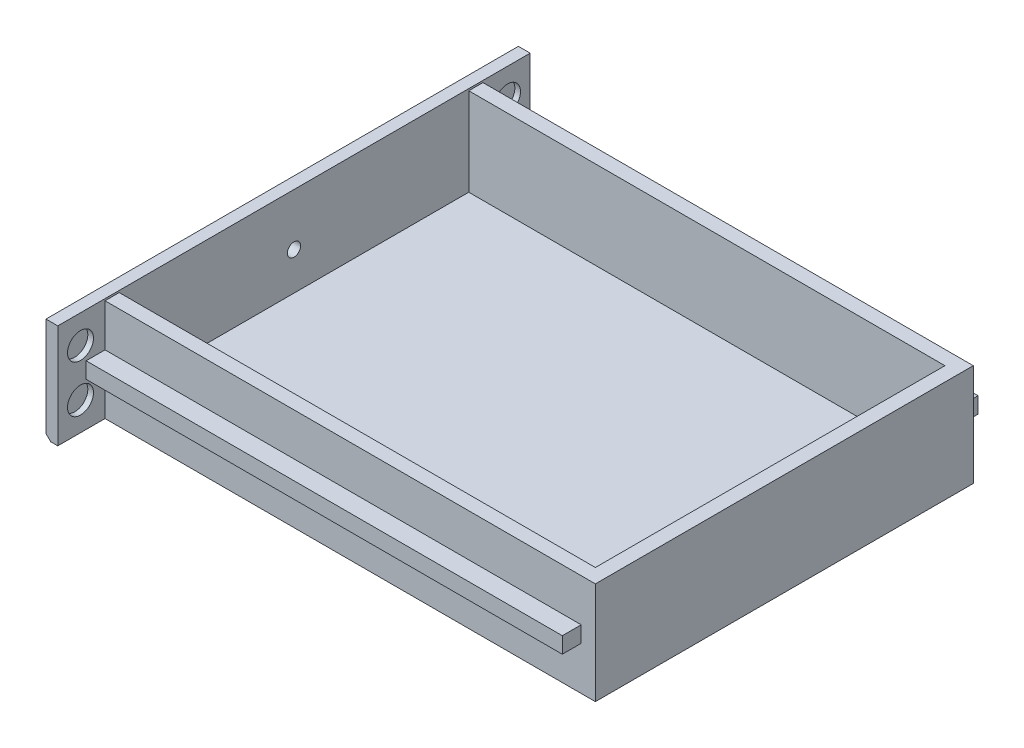
ISO-10303-21;
HEADER;
FILE_DESCRIPTION(('STEP AP214'),'2;1');
FILE_NAME('part.step','',(''),(''),'','','');
FILE_SCHEMA(('AUTOMOTIVE_DESIGN { 1 0 10303 214 1 1 1 1 }'));
ENDSEC;
DATA;
#1=APPLICATION_CONTEXT('core data for automotive mechanical design processes');
#2=APPLICATION_PROTOCOL_DEFINITION('international standard','automotive_design',2000,#1);
#3=PRODUCT_CONTEXT('',#1,'mechanical');
#4=PRODUCT('Part','Part','',(#3));
#5=PRODUCT_RELATED_PRODUCT_CATEGORY('part','',(#4));
#6=PRODUCT_DEFINITION_FORMATION('','',#4);
#7=PRODUCT_DEFINITION_CONTEXT('part definition',#1,'design');
#8=PRODUCT_DEFINITION('design','',#6,#7);
#9=PRODUCT_DEFINITION_SHAPE('','',#8);
#10=(LENGTH_UNIT() NAMED_UNIT(*) SI_UNIT(.MILLI.,.METRE.));
#11=(NAMED_UNIT(*) PLANE_ANGLE_UNIT() SI_UNIT($,.RADIAN.));
#12=(NAMED_UNIT(*) SI_UNIT($,.STERADIAN.) SOLID_ANGLE_UNIT());
#13=UNCERTAINTY_MEASURE_WITH_UNIT(LENGTH_MEASURE(1.E-05),#10,'distance_accuracy_value','');
#14=(GEOMETRIC_REPRESENTATION_CONTEXT(3) GLOBAL_UNCERTAINTY_ASSIGNED_CONTEXT((#13)) GLOBAL_UNIT_ASSIGNED_CONTEXT((#10,
#11,#12)) REPRESENTATION_CONTEXT('',''));
#15=CARTESIAN_POINT('',(0.,0.,0.));
#16=DIRECTION('',(0.,0.,1.));
#17=DIRECTION('',(1.,0.,0.));
#18=AXIS2_PLACEMENT_3D('',#15,#16,#17);
#19=CARTESIAN_POINT('',(103.3,0.,0.));
#20=DIRECTION('',(1.,0.,0.));
#21=DIRECTION('',(0.,0.,-1.));
#22=AXIS2_PLACEMENT_3D('',#19,#20,#21);
#23=PLANE('',#22);
#24=DIRECTION('',(0.,-1.,0.));
#25=VECTOR('',#24,1.);
#26=CARTESIAN_POINT('',(103.3,10.6,40.));
#27=LINE('',#26,#25);
#28=CARTESIAN_POINT('',(103.3,1.6,40.));
#29=VERTEX_POINT('',#28);
#30=CARTESIAN_POINT('',(103.3,-1.8,40.));
#31=VERTEX_POINT('',#30);
#32=EDGE_CURVE('E217',#29,#31,#27,.T.);
#33=ORIENTED_EDGE('',*,*,#32,.F.);
#34=DIRECTION('',(0.,0.,1.));
#35=VECTOR('',#34,1.);
#36=CARTESIAN_POINT('',(103.3,1.6,40.));
#37=LINE('',#36,#35);
#38=CARTESIAN_POINT('',(103.3,1.6,44.));
#39=VERTEX_POINT('',#38);
#40=EDGE_CURVE('E228',#29,#39,#37,.T.);
#41=ORIENTED_EDGE('',*,*,#40,.T.);
#42=DIRECTION('',(0.,-1.,0.));
#43=VECTOR('',#42,1.);
#44=CARTESIAN_POINT('',(103.3,1.6,44.));
#45=LINE('',#44,#43);
#46=CARTESIAN_POINT('',(103.3,-1.8,44.));
#47=VERTEX_POINT('',#46);
#48=EDGE_CURVE('E231',#39,#47,#45,.T.);
#49=ORIENTED_EDGE('',*,*,#48,.T.);
#50=DIRECTION('',(0.,0.,-1.));
#51=VECTOR('',#50,1.);
#52=CARTESIAN_POINT('',(103.3,-1.8,44.));
#53=LINE('',#52,#51);
#54=EDGE_CURVE('E233',#47,#31,#53,.T.);
#55=ORIENTED_EDGE('',*,*,#54,.T.);
#56=EDGE_LOOP('',(#33,#41,#49,#55));
#57=FACE_BOUND('',#56,.T.);
#58=ADVANCED_FACE('F34',(#57),#23,.T.);
#59=CARTESIAN_POINT('',(2.5,0.,0.));
#60=DIRECTION('',(-1.,0.,0.));
#61=DIRECTION('',(0.,0.,1.));
#62=AXIS2_PLACEMENT_3D('',#59,#60,#61);
#63=PLANE('',#62);
#64=CARTESIAN_POINT('',(2.5,0.,0.));
#65=DIRECTION('',(-1.,0.,0.));
#66=DIRECTION('',(0.,0.,1.));
#67=AXIS2_PLACEMENT_3D('',#64,#65,#66);
#68=CIRCLE('',#67,1.4);
#69=CARTESIAN_POINT('',(2.5,0.,1.4));
#70=VERTEX_POINT('',#69);
#71=EDGE_CURVE('E209',#70,#70,#68,.T.);
#72=ORIENTED_EDGE('',*,*,#71,.T.);
#73=EDGE_LOOP('',(#72));
#74=FACE_BOUND('',#73,.T.);
#75=CARTESIAN_POINT('',(2.5,5.,-45.2));
#76=DIRECTION('',(1.,0.,0.));
#77=DIRECTION('',(0.,0.,-1.));
#78=AXIS2_PLACEMENT_3D('',#75,#76,#77);
#79=CIRCLE('',#78,2.75);
#80=CARTESIAN_POINT('',(2.5,5.,-47.95));
#81=VERTEX_POINT('',#80);
#82=EDGE_CURVE('E331',#81,#81,#79,.T.);
#83=ORIENTED_EDGE('',*,*,#82,.F.);
#84=EDGE_LOOP('',(#83));
#85=FACE_BOUND('',#84,.T.);
#86=CARTESIAN_POINT('',(2.5,-5.,45.2));
#87=DIRECTION('',(1.,0.,0.));
#88=DIRECTION('',(0.,0.,1.));
#89=AXIS2_PLACEMENT_3D('',#86,#87,#88);
#90=CIRCLE('',#89,2.74999999999999);
#91=CARTESIAN_POINT('',(2.5,-5.,47.95));
#92=VERTEX_POINT('',#91);
#93=EDGE_CURVE('E327',#92,#92,#90,.T.);
#94=ORIENTED_EDGE('',*,*,#93,.F.);
#95=EDGE_LOOP('',(#94));
#96=FACE_BOUND('',#95,.T.);
#97=CARTESIAN_POINT('',(2.5,5.,45.2));
#98=DIRECTION('',(1.,0.,0.));
#99=DIRECTION('',(0.,0.,1.));
#100=AXIS2_PLACEMENT_3D('',#97,#98,#99);
#101=CIRCLE('',#100,2.75);
#102=CARTESIAN_POINT('',(2.5,5.,47.95));
#103=VERTEX_POINT('',#102);
#104=EDGE_CURVE('E338',#103,#103,#101,.T.);
#105=ORIENTED_EDGE('',*,*,#104,.F.);
#106=EDGE_LOOP('',(#105));
#107=FACE_BOUND('',#106,.T.);
#108=CARTESIAN_POINT('',(2.5,-5.,-45.2));
#109=DIRECTION('',(1.,0.,0.));
#110=DIRECTION('',(0.,0.,-1.));
#111=AXIS2_PLACEMENT_3D('',#108,#109,#110);
#112=CIRCLE('',#111,2.74999999999999);
#113=CARTESIAN_POINT('',(2.5,-5.,-47.95));
#114=VERTEX_POINT('',#113);
#115=EDGE_CURVE('E332',#114,#114,#112,.T.);
#116=ORIENTED_EDGE('',*,*,#115,.F.);
#117=EDGE_LOOP('',(#116));
#118=FACE_BOUND('',#117,.T.);
#119=DIRECTION('',(0.,1.,0.));
#120=VECTOR('',#119,1.);
#121=CARTESIAN_POINT('',(2.5,-1.8,-40.));
#122=LINE('',#121,#120);
#123=CARTESIAN_POINT('',(2.5,-11.,-40.));
#124=VERTEX_POINT('',#123);
#125=CARTESIAN_POINT('',(2.5,-1.8,-40.));
#126=VERTEX_POINT('',#125);
#127=EDGE_CURVE('E265',#124,#126,#122,.T.);
#128=ORIENTED_EDGE('',*,*,#127,.F.);
#129=DIRECTION('',(0.,0.,-1.));
#130=VECTOR('',#129,1.);
#131=CARTESIAN_POINT('',(2.5,-11.,50.));
#132=LINE('',#131,#130);
#133=CARTESIAN_POINT('',(2.5,-11.,-50.));
#134=VERTEX_POINT('',#133);
#135=EDGE_CURVE('E360',#124,#134,#132,.T.);
#136=ORIENTED_EDGE('',*,*,#135,.T.);
#137=DIRECTION('',(0.,1.,0.));
#138=VECTOR('',#137,1.);
#139=CARTESIAN_POINT('',(2.5,-11.,-50.));
#140=LINE('',#139,#138);
#141=CARTESIAN_POINT('',(2.5,11.,-50.));
#142=VERTEX_POINT('',#141);
#143=EDGE_CURVE('E352',#134,#142,#140,.T.);
#144=ORIENTED_EDGE('',*,*,#143,.T.);
#145=DIRECTION('',(0.,0.,1.));
#146=VECTOR('',#145,1.);
#147=CARTESIAN_POINT('',(2.5,11.,50.));
#148=LINE('',#147,#146);
#149=CARTESIAN_POINT('',(2.5,11.,50.));
#150=VERTEX_POINT('',#149);
#151=EDGE_CURVE('E355',#142,#150,#148,.T.);
#152=ORIENTED_EDGE('',*,*,#151,.T.);
#153=DIRECTION('',(0.,-1.,0.));
#154=VECTOR('',#153,1.);
#155=CARTESIAN_POINT('',(2.5,-11.,50.));
#156=LINE('',#155,#154);
#157=CARTESIAN_POINT('',(2.5,-11.,50.));
#158=VERTEX_POINT('',#157);
#159=EDGE_CURVE('E358',#150,#158,#156,.T.);
#160=ORIENTED_EDGE('',*,*,#159,.T.);
#161=CARTESIAN_POINT('',(2.5,-11.,40.));
#162=VERTEX_POINT('',#161);
#163=EDGE_CURVE('E361',#158,#162,#132,.T.);
#164=ORIENTED_EDGE('',*,*,#163,.T.);
#165=DIRECTION('',(0.,-1.,0.));
#166=VECTOR('',#165,1.);
#167=CARTESIAN_POINT('',(2.5,-1.8,40.));
#168=LINE('',#167,#166);
#169=CARTESIAN_POINT('',(2.5,-1.8,40.));
#170=VERTEX_POINT('',#169);
#171=EDGE_CURVE('E185',#170,#162,#168,.T.);
#172=ORIENTED_EDGE('',*,*,#171,.F.);
#173=DIRECTION('',(0.,0.,-1.));
#174=VECTOR('',#173,1.);
#175=CARTESIAN_POINT('',(2.5,-1.8,44.));
#176=LINE('',#175,#174);
#177=CARTESIAN_POINT('',(2.5,-1.8,44.));
#178=VERTEX_POINT('',#177);
#179=EDGE_CURVE('E261',#178,#170,#176,.T.);
#180=ORIENTED_EDGE('',*,*,#179,.F.);
#181=DIRECTION('',(0.,-1.,0.));
#182=VECTOR('',#181,1.);
#183=CARTESIAN_POINT('',(2.5,1.6,44.));
#184=LINE('',#183,#182);
#185=CARTESIAN_POINT('',(2.5,1.6,44.));
#186=VERTEX_POINT('',#185);
#187=EDGE_CURVE('E258',#186,#178,#184,.T.);
#188=ORIENTED_EDGE('',*,*,#187,.F.);
#189=DIRECTION('',(0.,0.,1.));
#190=VECTOR('',#189,1.);
#191=CARTESIAN_POINT('',(2.5,1.6,40.));
#192=LINE('',#191,#190);
#193=CARTESIAN_POINT('',(2.5,1.6,40.));
#194=VERTEX_POINT('',#193);
#195=EDGE_CURVE('E255',#194,#186,#192,.T.);
#196=ORIENTED_EDGE('',*,*,#195,.F.);
#197=DIRECTION('',(0.,-1.,0.));
#198=VECTOR('',#197,1.);
#199=CARTESIAN_POINT('',(2.5,1.6,40.));
#200=LINE('',#199,#198);
#201=CARTESIAN_POINT('',(2.5,10.6,40.));
#202=VERTEX_POINT('',#201);
#203=EDGE_CURVE('E253',#202,#194,#200,.T.);
#204=ORIENTED_EDGE('',*,*,#203,.F.);
#205=DIRECTION('',(0.,0.,1.));
#206=VECTOR('',#205,1.);
#207=CARTESIAN_POINT('',(2.5,10.6,40.));
#208=LINE('',#207,#206);
#209=CARTESIAN_POINT('',(2.5,10.6,37.));
#210=VERTEX_POINT('',#209);
#211=EDGE_CURVE('E250',#210,#202,#208,.T.);
#212=ORIENTED_EDGE('',*,*,#211,.F.);
#213=DIRECTION('',(0.,1.,0.));
#214=VECTOR('',#213,1.);
#215=CARTESIAN_POINT('',(2.5,10.6,37.));
#216=LINE('',#215,#214);
#217=CARTESIAN_POINT('',(2.5,-8.,37.));
#218=VERTEX_POINT('',#217);
#219=EDGE_CURVE('E216',#218,#210,#216,.T.);
#220=ORIENTED_EDGE('',*,*,#219,.F.);
#221=DIRECTION('',(0.,0.,1.));
#222=VECTOR('',#221,1.);
#223=CARTESIAN_POINT('',(2.5,-8.,37.));
#224=LINE('',#223,#222);
#225=CARTESIAN_POINT('',(2.5,-8.,-37.));
#226=VERTEX_POINT('',#225);
#227=EDGE_CURVE('E229',#226,#218,#224,.T.);
#228=ORIENTED_EDGE('',*,*,#227,.F.);
#229=DIRECTION('',(0.,-1.,0.));
#230=VECTOR('',#229,1.);
#231=CARTESIAN_POINT('',(2.5,10.6,-37.));
#232=LINE('',#231,#230);
#233=CARTESIAN_POINT('',(2.5,10.6,-37.));
#234=VERTEX_POINT('',#233);
#235=EDGE_CURVE('E283',#234,#226,#232,.T.);
#236=ORIENTED_EDGE('',*,*,#235,.F.);
#237=DIRECTION('',(0.,0.,1.));
#238=VECTOR('',#237,1.);
#239=CARTESIAN_POINT('',(2.5,10.6,-40.));
#240=LINE('',#239,#238);
#241=CARTESIAN_POINT('',(2.5,10.6,-40.));
#242=VERTEX_POINT('',#241);
#243=EDGE_CURVE('E280',#242,#234,#240,.T.);
#244=ORIENTED_EDGE('',*,*,#243,.F.);
#245=DIRECTION('',(0.,1.,0.));
#246=VECTOR('',#245,1.);
#247=CARTESIAN_POINT('',(2.5,1.6,-40.));
#248=LINE('',#247,#246);
#249=CARTESIAN_POINT('',(2.5,1.6,-40.));
#250=VERTEX_POINT('',#249);
#251=EDGE_CURVE('E277',#250,#242,#248,.T.);
#252=ORIENTED_EDGE('',*,*,#251,.F.);
#253=DIRECTION('',(0.,0.,1.));
#254=VECTOR('',#253,1.);
#255=CARTESIAN_POINT('',(2.5,1.6,-40.));
#256=LINE('',#255,#254);
#257=CARTESIAN_POINT('',(2.5,1.6,-44.));
#258=VERTEX_POINT('',#257);
#259=EDGE_CURVE('E274',#258,#250,#256,.T.);
#260=ORIENTED_EDGE('',*,*,#259,.F.);
#261=DIRECTION('',(0.,1.,0.));
#262=VECTOR('',#261,1.);
#263=CARTESIAN_POINT('',(2.5,1.6,-44.));
#264=LINE('',#263,#262);
#265=CARTESIAN_POINT('',(2.5,-1.8,-44.));
#266=VERTEX_POINT('',#265);
#267=EDGE_CURVE('E271',#266,#258,#264,.T.);
#268=ORIENTED_EDGE('',*,*,#267,.F.);
#269=DIRECTION('',(0.,0.,-1.));
#270=VECTOR('',#269,1.);
#271=CARTESIAN_POINT('',(2.5,-1.8,-44.));
#272=LINE('',#271,#270);
#273=EDGE_CURVE('E268',#126,#266,#272,.T.);
#274=ORIENTED_EDGE('',*,*,#273,.F.);
#275=EDGE_LOOP('',(#128,#136,#144,#152,#160,#164,#172,#180,#188,#196,#204,#212,#220,#228,#236,
#244,#252,#260,#268,#274));
#276=FACE_BOUND('',#275,.T.);
#277=ADVANCED_FACE('F387',(#74,#85,#96,#107,#118,#276),#63,.F.);
#278=CARTESIAN_POINT('',(2.5,-11.,-50.));
#279=DIRECTION('',(0.,0.,1.));
#280=DIRECTION('',(1.,0.,0.));
#281=AXIS2_PLACEMENT_3D('',#278,#279,#280);
#282=PLANE('',#281);
#283=DIRECTION('',(-1.,0.,0.));
#284=VECTOR('',#283,1.);
#285=CARTESIAN_POINT('',(2.5,-11.,-50.));
#286=LINE('',#285,#284);
#287=CARTESIAN_POINT('',(0.999999999999987,-11.,-50.));
#288=VERTEX_POINT('',#287);
#289=EDGE_CURVE('E363',#134,#288,#286,.T.);
#290=ORIENTED_EDGE('',*,*,#289,.T.);
#291=DIRECTION('',(-0.707106781186548,0.707106781186548,0.));
#292=VECTOR('',#291,1.);
#293=CARTESIAN_POINT('',(0.999999999999987,-11.,-50.));
#294=LINE('',#293,#292);
#295=CARTESIAN_POINT('',(0.,-10.,-50.));
#296=VERTEX_POINT('',#295);
#297=EDGE_CURVE('E56',#288,#296,#294,.T.);
#298=ORIENTED_EDGE('',*,*,#297,.T.);
#299=DIRECTION('',(0.,1.,0.));
#300=VECTOR('',#299,1.);
#301=CARTESIAN_POINT('',(0.,-11.,-50.));
#302=LINE('',#301,#300);
#303=CARTESIAN_POINT('',(0.,11.,-50.));
#304=VERTEX_POINT('',#303);
#305=EDGE_CURVE('E349',#296,#304,#302,.T.);
#306=ORIENTED_EDGE('',*,*,#305,.T.);
#307=DIRECTION('',(-1.,0.,0.));
#308=VECTOR('',#307,1.);
#309=CARTESIAN_POINT('',(2.5,11.,-50.));
#310=LINE('',#309,#308);
#311=EDGE_CURVE('E223',#142,#304,#310,.T.);
#312=ORIENTED_EDGE('',*,*,#311,.F.);
#313=ORIENTED_EDGE('',*,*,#143,.F.);
#314=EDGE_LOOP('',(#290,#298,#306,#312,#313));
#315=FACE_BOUND('',#314,.T.);
#316=ADVANCED_FACE('F384',(#315),#282,.F.);
#317=CARTESIAN_POINT('',(2.5,11.,50.));
#318=DIRECTION('',(0.,-1.,0.));
#319=DIRECTION('',(0.,0.,-1.));
#320=AXIS2_PLACEMENT_3D('',#317,#318,#319);
#321=PLANE('',#320);
#322=DIRECTION('',(0.,0.,1.));
#323=VECTOR('',#322,1.);
#324=CARTESIAN_POINT('',(0.,11.,50.));
#325=LINE('',#324,#323);
#326=CARTESIAN_POINT('',(0.,11.,50.));
#327=VERTEX_POINT('',#326);
#328=EDGE_CURVE('E365',#304,#327,#325,.T.);
#329=ORIENTED_EDGE('',*,*,#328,.T.);
#330=DIRECTION('',(-1.,0.,0.));
#331=VECTOR('',#330,1.);
#332=CARTESIAN_POINT('',(2.5,11.,50.));
#333=LINE('',#332,#331);
#334=EDGE_CURVE('E371',#150,#327,#333,.T.);
#335=ORIENTED_EDGE('',*,*,#334,.F.);
#336=ORIENTED_EDGE('',*,*,#151,.F.);
#337=ORIENTED_EDGE('',*,*,#311,.T.);
#338=EDGE_LOOP('',(#329,#335,#336,#337));
#339=FACE_BOUND('',#338,.T.);
#340=ADVANCED_FACE('F505',(#339),#321,.F.);
#341=CARTESIAN_POINT('',(2.5,-11.,50.));
#342=DIRECTION('',(0.,0.,-1.));
#343=DIRECTION('',(-1.,0.,0.));
#344=AXIS2_PLACEMENT_3D('',#341,#342,#343);
#345=PLANE('',#344);
#346=DIRECTION('',(0.,-1.,0.));
#347=VECTOR('',#346,1.);
#348=CARTESIAN_POINT('',(0.,-11.,50.));
#349=LINE('',#348,#347);
#350=CARTESIAN_POINT('',(0.,-10.,50.));
#351=VERTEX_POINT('',#350);
#352=EDGE_CURVE('E356',#327,#351,#349,.T.);
#353=ORIENTED_EDGE('',*,*,#352,.T.);
#354=DIRECTION('',(0.707106781186548,-0.707106781186548,0.));
#355=VECTOR('',#354,1.);
#356=CARTESIAN_POINT('',(0.999999999999987,-11.,50.));
#357=LINE('',#356,#355);
#358=CARTESIAN_POINT('',(0.999999999999987,-11.,50.));
#359=VERTEX_POINT('',#358);
#360=EDGE_CURVE('E11',#351,#359,#357,.T.);
#361=ORIENTED_EDGE('',*,*,#360,.T.);
#362=DIRECTION('',(-1.,0.,0.));
#363=VECTOR('',#362,1.);
#364=CARTESIAN_POINT('',(2.5,-11.,50.));
#365=LINE('',#364,#363);
#366=EDGE_CURVE('E369',#158,#359,#365,.T.);
#367=ORIENTED_EDGE('',*,*,#366,.F.);
#368=ORIENTED_EDGE('',*,*,#159,.F.);
#369=ORIENTED_EDGE('',*,*,#334,.T.);
#370=EDGE_LOOP('',(#353,#361,#367,#368,#369));
#371=FACE_BOUND('',#370,.T.);
#372=ADVANCED_FACE('F502',(#371),#345,.F.);
#373=CARTESIAN_POINT('',(2.5,-11.,50.));
#374=DIRECTION('',(0.,1.,0.));
#375=DIRECTION('',(0.,0.,1.));
#376=AXIS2_PLACEMENT_3D('',#373,#374,#375);
#377=PLANE('',#376);
#378=ORIENTED_EDGE('',*,*,#366,.T.);
#379=DIRECTION('',(0.,0.,-1.));
#380=VECTOR('',#379,1.);
#381=CARTESIAN_POINT('',(0.999999999999987,-11.,-50.));
#382=LINE('',#381,#380);
#383=EDGE_CURVE('E220',#359,#288,#382,.T.);
#384=ORIENTED_EDGE('',*,*,#383,.T.);
#385=ORIENTED_EDGE('',*,*,#289,.F.);
#386=ORIENTED_EDGE('',*,*,#135,.F.);
#387=DIRECTION('',(-1.,0.,0.));
#388=VECTOR('',#387,1.);
#389=CARTESIAN_POINT('',(103.3,-11.,-40.));
#390=LINE('',#389,#388);
#391=CARTESIAN_POINT('',(106.3,-11.,-40.));
#392=VERTEX_POINT('',#391);
#393=EDGE_CURVE('E189',#392,#124,#390,.T.);
#394=ORIENTED_EDGE('',*,*,#393,.F.);
#395=DIRECTION('',(0.,0.,-1.));
#396=VECTOR('',#395,1.);
#397=CARTESIAN_POINT('',(106.3,-11.,40.));
#398=LINE('',#397,#396);
#399=CARTESIAN_POINT('',(106.3,-11.,40.));
#400=VERTEX_POINT('',#399);
#401=EDGE_CURVE('E192',#400,#392,#398,.T.);
#402=ORIENTED_EDGE('',*,*,#401,.F.);
#403=DIRECTION('',(-1.,0.,0.));
#404=VECTOR('',#403,1.);
#405=CARTESIAN_POINT('',(103.3,-11.,40.));
#406=LINE('',#405,#404);
#407=EDGE_CURVE('E177',#400,#162,#406,.T.);
#408=ORIENTED_EDGE('',*,*,#407,.T.);
#409=ORIENTED_EDGE('',*,*,#163,.F.);
#410=EDGE_LOOP('',(#378,#384,#385,#386,#394,#402,#408,#409));
#411=FACE_BOUND('',#410,.T.);
#412=ADVANCED_FACE('F194',(#411),#377,.F.);
#413=CARTESIAN_POINT('',(0.,0.,0.));
#414=DIRECTION('',(-1.,0.,0.));
#415=DIRECTION('',(0.,0.,1.));
#416=AXIS2_PLACEMENT_3D('',#413,#414,#415);
#417=PLANE('',#416);
#418=CARTESIAN_POINT('',(0.,0.,0.));
#419=DIRECTION('',(-1.,0.,0.));
#420=DIRECTION('',(0.,0.,1.));
#421=AXIS2_PLACEMENT_3D('',#418,#419,#420);
#422=CIRCLE('',#421,1.4);
#423=CARTESIAN_POINT('',(0.,0.,1.4));
#424=VERTEX_POINT('',#423);
#425=EDGE_CURVE('E700',#424,#424,#422,.T.);
#426=ORIENTED_EDGE('',*,*,#425,.F.);
#427=EDGE_LOOP('',(#426));
#428=FACE_BOUND('',#427,.T.);
#429=ORIENTED_EDGE('',*,*,#305,.F.);
#430=DIRECTION('',(0.,0.,1.));
#431=VECTOR('',#430,1.);
#432=CARTESIAN_POINT('',(0.,-10.,50.));
#433=LINE('',#432,#431);
#434=EDGE_CURVE('E42',#296,#351,#433,.T.);
#435=ORIENTED_EDGE('',*,*,#434,.T.);
#436=ORIENTED_EDGE('',*,*,#352,.F.);
#437=ORIENTED_EDGE('',*,*,#328,.F.);
#438=EDGE_LOOP('',(#429,#435,#436,#437));
#439=FACE_BOUND('',#438,.T.);
#440=ADVANCED_FACE('F494',(#428,#439),#417,.T.);
#441=CARTESIAN_POINT('',(1.3,5.,-45.2));
#442=DIRECTION('',(1.,0.,0.));
#443=DIRECTION('',(0.,0.,-1.));
#444=AXIS2_PLACEMENT_3D('',#441,#442,#443);
#445=CYLINDRICAL_SURFACE('',#444,2.75);
#446=CARTESIAN_POINT('',(1.3,5.,-45.2));
#447=DIRECTION('',(1.,0.,0.));
#448=DIRECTION('',(0.,0.,-1.));
#449=AXIS2_PLACEMENT_3D('',#446,#447,#448);
#450=CIRCLE('',#449,2.75);
#451=CARTESIAN_POINT('',(1.3,5.,-47.95));
#452=VERTEX_POINT('',#451);
#453=EDGE_CURVE('E346',#452,#452,#450,.T.);
#454=ORIENTED_EDGE('',*,*,#453,.F.);
#455=EDGE_LOOP('',(#454));
#456=FACE_BOUND('',#455,.T.);
#457=ORIENTED_EDGE('',*,*,#82,.T.);
#458=EDGE_LOOP('',(#457));
#459=FACE_BOUND('',#458,.T.);
#460=ADVANCED_FACE('F491',(#456,#459),#445,.F.);
#461=CARTESIAN_POINT('',(1.3,5.,-45.2));
#462=DIRECTION('',(1.,0.,0.));
#463=DIRECTION('',(0.,0.,-1.));
#464=AXIS2_PLACEMENT_3D('',#461,#462,#463);
#465=PLANE('',#464);
#466=ORIENTED_EDGE('',*,*,#453,.T.);
#467=EDGE_LOOP('',(#466));
#468=FACE_BOUND('',#467,.T.);
#469=ADVANCED_FACE('F487',(#468),#465,.T.);
#470=CARTESIAN_POINT('',(1.3,-5.,45.2));
#471=DIRECTION('',(1.,0.,0.));
#472=DIRECTION('',(0.,0.,-1.));
#473=AXIS2_PLACEMENT_3D('',#470,#471,#472);
#474=CYLINDRICAL_SURFACE('',#473,2.74999999999999);
#475=CARTESIAN_POINT('',(1.3,-5.,45.2));
#476=DIRECTION('',(1.,0.,0.));
#477=DIRECTION('',(0.,0.,1.));
#478=AXIS2_PLACEMENT_3D('',#475,#476,#477);
#479=CIRCLE('',#478,2.74999999999999);
#480=CARTESIAN_POINT('',(1.3,-5.,47.95));
#481=VERTEX_POINT('',#480);
#482=EDGE_CURVE('E341',#481,#481,#479,.T.);
#483=ORIENTED_EDGE('',*,*,#482,.F.);
#484=EDGE_LOOP('',(#483));
#485=FACE_BOUND('',#484,.T.);
#486=ORIENTED_EDGE('',*,*,#93,.T.);
#487=EDGE_LOOP('',(#486));
#488=FACE_BOUND('',#487,.T.);
#489=ADVANCED_FACE('F483',(#485,#488),#474,.F.);
#490=CARTESIAN_POINT('',(1.3,-5.,45.2));
#491=DIRECTION('',(-1.,0.,0.));
#492=DIRECTION('',(0.,0.,1.));
#493=AXIS2_PLACEMENT_3D('',#490,#491,#492);
#494=PLANE('',#493);
#495=ORIENTED_EDGE('',*,*,#482,.T.);
#496=EDGE_LOOP('',(#495));
#497=FACE_BOUND('',#496,.T.);
#498=ADVANCED_FACE('F479',(#497),#494,.F.);
#499=CARTESIAN_POINT('',(1.3,5.,45.2));
#500=DIRECTION('',(1.,0.,0.));
#501=DIRECTION('',(0.,0.,-1.));
#502=AXIS2_PLACEMENT_3D('',#499,#500,#501);
#503=CYLINDRICAL_SURFACE('',#502,2.75);
#504=CARTESIAN_POINT('',(1.3,5.,45.2));
#505=DIRECTION('',(1.,0.,0.));
#506=DIRECTION('',(0.,0.,1.));
#507=AXIS2_PLACEMENT_3D('',#504,#505,#506);
#508=CIRCLE('',#507,2.75);
#509=CARTESIAN_POINT('',(1.3,5.,47.95));
#510=VERTEX_POINT('',#509);
#511=EDGE_CURVE('E335',#510,#510,#508,.T.);
#512=ORIENTED_EDGE('',*,*,#511,.F.);
#513=EDGE_LOOP('',(#512));
#514=FACE_BOUND('',#513,.T.);
#515=ORIENTED_EDGE('',*,*,#104,.T.);
#516=EDGE_LOOP('',(#515));
#517=FACE_BOUND('',#516,.T.);
#518=ADVANCED_FACE('F475',(#514,#517),#503,.F.);
#519=CARTESIAN_POINT('',(1.3,5.,45.2));
#520=DIRECTION('',(-1.,0.,0.));
#521=DIRECTION('',(0.,0.,1.));
#522=AXIS2_PLACEMENT_3D('',#519,#520,#521);
#523=PLANE('',#522);
#524=ORIENTED_EDGE('',*,*,#511,.T.);
#525=EDGE_LOOP('',(#524));
#526=FACE_BOUND('',#525,.T.);
#527=ADVANCED_FACE('F471',(#526),#523,.F.);
#528=CARTESIAN_POINT('',(1.3,-5.,-45.2));
#529=DIRECTION('',(1.,0.,0.));
#530=DIRECTION('',(0.,0.,-1.));
#531=AXIS2_PLACEMENT_3D('',#528,#529,#530);
#532=CYLINDRICAL_SURFACE('',#531,2.74999999999999);
#533=CARTESIAN_POINT('',(1.3,-5.,-45.2));
#534=DIRECTION('',(1.,0.,0.));
#535=DIRECTION('',(0.,0.,-1.));
#536=AXIS2_PLACEMENT_3D('',#533,#534,#535);
#537=CIRCLE('',#536,2.74999999999999);
#538=CARTESIAN_POINT('',(1.3,-5.,-47.95));
#539=VERTEX_POINT('',#538);
#540=EDGE_CURVE('E328',#539,#539,#537,.T.);
#541=ORIENTED_EDGE('',*,*,#540,.F.);
#542=EDGE_LOOP('',(#541));
#543=FACE_BOUND('',#542,.T.);
#544=ORIENTED_EDGE('',*,*,#115,.T.);
#545=EDGE_LOOP('',(#544));
#546=FACE_BOUND('',#545,.T.);
#547=ADVANCED_FACE('F464',(#543,#546),#532,.F.);
#548=CARTESIAN_POINT('',(1.3,-5.,-45.2));
#549=DIRECTION('',(1.,0.,0.));
#550=DIRECTION('',(0.,0.,-1.));
#551=AXIS2_PLACEMENT_3D('',#548,#549,#550);
#552=PLANE('',#551);
#553=ORIENTED_EDGE('',*,*,#540,.T.);
#554=EDGE_LOOP('',(#553));
#555=FACE_BOUND('',#554,.T.);
#556=ADVANCED_FACE('F457',(#555),#552,.T.);
#557=CARTESIAN_POINT('',(103.3,10.6,37.));
#558=DIRECTION('',(0.,0.,1.));
#559=DIRECTION('',(1.,0.,0.));
#560=AXIS2_PLACEMENT_3D('',#557,#558,#559);
#561=PLANE('',#560);
#562=ORIENTED_EDGE('',*,*,#219,.T.);
#563=DIRECTION('',(-1.,0.,0.));
#564=VECTOR('',#563,1.);
#565=CARTESIAN_POINT('',(103.3,10.6,37.));
#566=LINE('',#565,#564);
#567=CARTESIAN_POINT('',(103.3,10.6,37.));
#568=VERTEX_POINT('',#567);
#569=EDGE_CURVE('E324',#568,#210,#566,.T.);
#570=ORIENTED_EDGE('',*,*,#569,.F.);
#571=DIRECTION('',(0.,1.,0.));
#572=VECTOR('',#571,1.);
#573=CARTESIAN_POINT('',(103.3,10.6,37.));
#574=LINE('',#573,#572);
#575=CARTESIAN_POINT('',(103.3,-8.,37.));
#576=VERTEX_POINT('',#575);
#577=EDGE_CURVE('E225',#576,#568,#574,.T.);
#578=ORIENTED_EDGE('',*,*,#577,.F.);
#579=DIRECTION('',(-1.,0.,0.));
#580=VECTOR('',#579,1.);
#581=CARTESIAN_POINT('',(103.3,-8.,37.));
#582=LINE('',#581,#580);
#583=EDGE_CURVE('E247',#576,#218,#582,.T.);
#584=ORIENTED_EDGE('',*,*,#583,.T.);
#585=EDGE_LOOP('',(#562,#570,#578,#584));
#586=FACE_BOUND('',#585,.T.);
#587=ADVANCED_FACE('F455',(#586),#561,.F.);
#588=CARTESIAN_POINT('',(103.3,10.6,40.));
#589=DIRECTION('',(0.,-1.,0.));
#590=DIRECTION('',(0.,0.,-1.));
#591=AXIS2_PLACEMENT_3D('',#588,#589,#590);
#592=PLANE('',#591);
#593=ORIENTED_EDGE('',*,*,#211,.T.);
#594=DIRECTION('',(-1.,0.,0.));
#595=VECTOR('',#594,1.);
#596=CARTESIAN_POINT('',(103.3,10.6,40.));
#597=LINE('',#596,#595);
#598=CARTESIAN_POINT('',(106.3,10.6,40.));
#599=VERTEX_POINT('',#598);
#600=EDGE_CURVE('E322',#599,#202,#597,.T.);
#601=ORIENTED_EDGE('',*,*,#600,.F.);
#602=DIRECTION('',(0.,0.,1.));
#603=VECTOR('',#602,1.);
#604=CARTESIAN_POINT('',(106.3,10.6,40.));
#605=LINE('',#604,#603);
#606=CARTESIAN_POINT('',(106.3,10.6,-40.));
#607=VERTEX_POINT('',#606);
#608=EDGE_CURVE('E205',#607,#599,#605,.T.);
#609=ORIENTED_EDGE('',*,*,#608,.F.);
#610=DIRECTION('',(-1.,0.,0.));
#611=VECTOR('',#610,1.);
#612=CARTESIAN_POINT('',(103.3,10.6,-40.));
#613=LINE('',#612,#611);
#614=EDGE_CURVE('E296',#607,#242,#613,.T.);
#615=ORIENTED_EDGE('',*,*,#614,.T.);
#616=ORIENTED_EDGE('',*,*,#243,.T.);
#617=DIRECTION('',(-1.,0.,0.));
#618=VECTOR('',#617,1.);
#619=CARTESIAN_POINT('',(103.3,10.6,-37.));
#620=LINE('',#619,#618);
#621=CARTESIAN_POINT('',(103.3,10.6,-37.));
#622=VERTEX_POINT('',#621);
#623=EDGE_CURVE('E293',#622,#234,#620,.T.);
#624=ORIENTED_EDGE('',*,*,#623,.F.);
#625=DIRECTION('',(0.,0.,1.));
#626=VECTOR('',#625,1.);
#627=CARTESIAN_POINT('',(103.3,10.6,40.));
#628=LINE('',#627,#626);
#629=EDGE_CURVE('E206',#622,#568,#628,.T.);
#630=ORIENTED_EDGE('',*,*,#629,.T.);
#631=ORIENTED_EDGE('',*,*,#569,.T.);
#632=EDGE_LOOP('',(#593,#601,#609,#615,#616,#624,#630,#631));
#633=FACE_BOUND('',#632,.T.);
#634=ADVANCED_FACE('F393',(#633),#592,.F.);
#635=CARTESIAN_POINT('',(103.3,1.6,40.));
#636=DIRECTION('',(0.,0.,-1.));
#637=DIRECTION('',(-1.,0.,0.));
#638=AXIS2_PLACEMENT_3D('',#635,#636,#637);
#639=PLANE('',#638);
#640=ORIENTED_EDGE('',*,*,#203,.T.);
#641=DIRECTION('',(-1.,0.,0.));
#642=VECTOR('',#641,1.);
#643=CARTESIAN_POINT('',(103.3,1.6,40.));
#644=LINE('',#643,#642);
#645=EDGE_CURVE('E319',#29,#194,#644,.T.);
#646=ORIENTED_EDGE('',*,*,#645,.F.);
#647=ORIENTED_EDGE('',*,*,#32,.T.);
#648=DIRECTION('',(-1.,0.,0.));
#649=VECTOR('',#648,1.);
#650=CARTESIAN_POINT('',(103.3,-1.8,40.));
#651=LINE('',#650,#649);
#652=EDGE_CURVE('E188',#31,#170,#651,.T.);
#653=ORIENTED_EDGE('',*,*,#652,.T.);
#654=ORIENTED_EDGE('',*,*,#171,.T.);
#655=ORIENTED_EDGE('',*,*,#407,.F.);
#656=DIRECTION('',(0.,-1.,0.));
#657=VECTOR('',#656,1.);
#658=CARTESIAN_POINT('',(106.3,10.6,40.));
#659=LINE('',#658,#657);
#660=EDGE_CURVE('E183',#599,#400,#659,.T.);
#661=ORIENTED_EDGE('',*,*,#660,.F.);
#662=ORIENTED_EDGE('',*,*,#600,.T.);
#663=EDGE_LOOP('',(#640,#646,#647,#653,#654,#655,#661,#662));
#664=FACE_BOUND('',#663,.T.);
#665=ADVANCED_FACE('F180',(#664),#639,.F.);
#666=CARTESIAN_POINT('',(103.3,1.6,40.));
#667=DIRECTION('',(0.,-1.,0.));
#668=DIRECTION('',(0.,0.,-1.));
#669=AXIS2_PLACEMENT_3D('',#666,#667,#668);
#670=PLANE('',#669);
#671=ORIENTED_EDGE('',*,*,#195,.T.);
#672=DIRECTION('',(-1.,0.,0.));
#673=VECTOR('',#672,1.);
#674=CARTESIAN_POINT('',(103.3,1.6,44.));
#675=LINE('',#674,#673);
#676=EDGE_CURVE('E316',#39,#186,#675,.T.);
#677=ORIENTED_EDGE('',*,*,#676,.F.);
#678=ORIENTED_EDGE('',*,*,#40,.F.);
#679=ORIENTED_EDGE('',*,*,#645,.T.);
#680=EDGE_LOOP('',(#671,#677,#678,#679));
#681=FACE_BOUND('',#680,.T.);
#682=ADVANCED_FACE('F397',(#681),#670,.F.);
#683=CARTESIAN_POINT('',(103.3,1.6,44.));
#684=DIRECTION('',(0.,0.,-1.));
#685=DIRECTION('',(-1.,0.,0.));
#686=AXIS2_PLACEMENT_3D('',#683,#684,#685);
#687=PLANE('',#686);
#688=ORIENTED_EDGE('',*,*,#187,.T.);
#689=DIRECTION('',(-1.,0.,0.));
#690=VECTOR('',#689,1.);
#691=CARTESIAN_POINT('',(103.3,-1.8,44.));
#692=LINE('',#691,#690);
#693=EDGE_CURVE('E313',#47,#178,#692,.T.);
#694=ORIENTED_EDGE('',*,*,#693,.F.);
#695=ORIENTED_EDGE('',*,*,#48,.F.);
#696=ORIENTED_EDGE('',*,*,#676,.T.);
#697=EDGE_LOOP('',(#688,#694,#695,#696));
#698=FACE_BOUND('',#697,.T.);
#699=ADVANCED_FACE('F407',(#698),#687,.F.);
#700=CARTESIAN_POINT('',(103.3,-1.8,44.));
#701=DIRECTION('',(0.,1.,0.));
#702=DIRECTION('',(0.,0.,1.));
#703=AXIS2_PLACEMENT_3D('',#700,#701,#702);
#704=PLANE('',#703);
#705=ORIENTED_EDGE('',*,*,#179,.T.);
#706=ORIENTED_EDGE('',*,*,#652,.F.);
#707=ORIENTED_EDGE('',*,*,#54,.F.);
#708=ORIENTED_EDGE('',*,*,#693,.T.);
#709=EDGE_LOOP('',(#705,#706,#707,#708));
#710=FACE_BOUND('',#709,.T.);
#711=ADVANCED_FACE('F405',(#710),#704,.F.);
#712=CARTESIAN_POINT('',(103.3,-1.8,-40.));
#713=DIRECTION('',(0.,0.,1.));
#714=DIRECTION('',(1.,0.,0.));
#715=AXIS2_PLACEMENT_3D('',#712,#713,#714);
#716=PLANE('',#715);
#717=ORIENTED_EDGE('',*,*,#127,.T.);
#718=DIRECTION('',(-1.,0.,0.));
#719=VECTOR('',#718,1.);
#720=CARTESIAN_POINT('',(103.3,-1.8,-40.));
#721=LINE('',#720,#719);
#722=CARTESIAN_POINT('',(103.3,-1.8,-40.));
#723=VERTEX_POINT('',#722);
#724=EDGE_CURVE('E308',#723,#126,#721,.T.);
#725=ORIENTED_EDGE('',*,*,#724,.F.);
#726=DIRECTION('',(0.,1.,0.));
#727=VECTOR('',#726,1.);
#728=CARTESIAN_POINT('',(103.3,10.6,-40.));
#729=LINE('',#728,#727);
#730=CARTESIAN_POINT('',(103.3,1.6,-40.));
#731=VERTEX_POINT('',#730);
#732=EDGE_CURVE('E221',#723,#731,#729,.T.);
#733=ORIENTED_EDGE('',*,*,#732,.T.);
#734=DIRECTION('',(-1.,0.,0.));
#735=VECTOR('',#734,1.);
#736=CARTESIAN_POINT('',(103.3,1.6,-40.));
#737=LINE('',#736,#735);
#738=EDGE_CURVE('E299',#731,#250,#737,.T.);
#739=ORIENTED_EDGE('',*,*,#738,.T.);
#740=ORIENTED_EDGE('',*,*,#251,.T.);
#741=ORIENTED_EDGE('',*,*,#614,.F.);
#742=DIRECTION('',(0.,1.,0.));
#743=VECTOR('',#742,1.);
#744=CARTESIAN_POINT('',(106.3,10.6,-40.));
#745=LINE('',#744,#743);
#746=EDGE_CURVE('E200',#392,#607,#745,.T.);
#747=ORIENTED_EDGE('',*,*,#746,.F.);
#748=ORIENTED_EDGE('',*,*,#393,.T.);
#749=EDGE_LOOP('',(#717,#725,#733,#739,#740,#741,#747,#748));
#750=FACE_BOUND('',#749,.T.);
#751=ADVANCED_FACE('F390',(#750),#716,.F.);
#752=CARTESIAN_POINT('',(103.3,-1.8,-44.));
#753=DIRECTION('',(0.,1.,0.));
#754=DIRECTION('',(0.,0.,1.));
#755=AXIS2_PLACEMENT_3D('',#752,#753,#754);
#756=PLANE('',#755);
#757=ORIENTED_EDGE('',*,*,#273,.T.);
#758=DIRECTION('',(-1.,0.,0.));
#759=VECTOR('',#758,1.);
#760=CARTESIAN_POINT('',(103.3,-1.8,-44.));
#761=LINE('',#760,#759);
#762=CARTESIAN_POINT('',(103.3,-1.8,-44.));
#763=VERTEX_POINT('',#762);
#764=EDGE_CURVE('E305',#763,#266,#761,.T.);
#765=ORIENTED_EDGE('',*,*,#764,.F.);
#766=DIRECTION('',(0.,0.,-1.));
#767=VECTOR('',#766,1.);
#768=CARTESIAN_POINT('',(103.3,-1.8,-44.));
#769=LINE('',#768,#767);
#770=EDGE_CURVE('E235',#723,#763,#769,.T.);
#771=ORIENTED_EDGE('',*,*,#770,.F.);
#772=ORIENTED_EDGE('',*,*,#724,.T.);
#773=EDGE_LOOP('',(#757,#765,#771,#772));
#774=FACE_BOUND('',#773,.T.);
#775=ADVANCED_FACE('F442',(#774),#756,.F.);
#776=CARTESIAN_POINT('',(103.3,1.6,-44.));
#777=DIRECTION('',(0.,0.,1.));
#778=DIRECTION('',(1.,0.,0.));
#779=AXIS2_PLACEMENT_3D('',#776,#777,#778);
#780=PLANE('',#779);
#781=ORIENTED_EDGE('',*,*,#267,.T.);
#782=DIRECTION('',(-1.,0.,0.));
#783=VECTOR('',#782,1.);
#784=CARTESIAN_POINT('',(103.3,1.6,-44.));
#785=LINE('',#784,#783);
#786=CARTESIAN_POINT('',(103.3,1.6,-44.));
#787=VERTEX_POINT('',#786);
#788=EDGE_CURVE('E302',#787,#258,#785,.T.);
#789=ORIENTED_EDGE('',*,*,#788,.F.);
#790=DIRECTION('',(0.,1.,0.));
#791=VECTOR('',#790,1.);
#792=CARTESIAN_POINT('',(103.3,1.6,-44.));
#793=LINE('',#792,#791);
#794=EDGE_CURVE('E237',#763,#787,#793,.T.);
#795=ORIENTED_EDGE('',*,*,#794,.F.);
#796=ORIENTED_EDGE('',*,*,#764,.T.);
#797=EDGE_LOOP('',(#781,#789,#795,#796));
#798=FACE_BOUND('',#797,.T.);
#799=ADVANCED_FACE('F446',(#798),#780,.F.);
#800=CARTESIAN_POINT('',(103.3,1.6,-40.));
#801=DIRECTION('',(0.,-1.,0.));
#802=DIRECTION('',(0.,0.,-1.));
#803=AXIS2_PLACEMENT_3D('',#800,#801,#802);
#804=PLANE('',#803);
#805=ORIENTED_EDGE('',*,*,#259,.T.);
#806=ORIENTED_EDGE('',*,*,#738,.F.);
#807=DIRECTION('',(0.,0.,1.));
#808=VECTOR('',#807,1.);
#809=CARTESIAN_POINT('',(103.3,1.6,-40.));
#810=LINE('',#809,#808);
#811=EDGE_CURVE('E239',#787,#731,#810,.T.);
#812=ORIENTED_EDGE('',*,*,#811,.F.);
#813=ORIENTED_EDGE('',*,*,#788,.T.);
#814=EDGE_LOOP('',(#805,#806,#812,#813));
#815=FACE_BOUND('',#814,.T.);
#816=ADVANCED_FACE('F448',(#815),#804,.F.);
#817=CARTESIAN_POINT('',(103.3,10.6,-37.));
#818=DIRECTION('',(0.,0.,-1.));
#819=DIRECTION('',(-1.,0.,0.));
#820=AXIS2_PLACEMENT_3D('',#817,#818,#819);
#821=PLANE('',#820);
#822=ORIENTED_EDGE('',*,*,#235,.T.);
#823=DIRECTION('',(-1.,0.,0.));
#824=VECTOR('',#823,1.);
#825=CARTESIAN_POINT('',(103.3,-8.,-37.));
#826=LINE('',#825,#824);
#827=CARTESIAN_POINT('',(103.3,-8.,-37.));
#828=VERTEX_POINT('',#827);
#829=EDGE_CURVE('E290',#828,#226,#826,.T.);
#830=ORIENTED_EDGE('',*,*,#829,.F.);
#831=DIRECTION('',(0.,-1.,0.));
#832=VECTOR('',#831,1.);
#833=CARTESIAN_POINT('',(103.3,10.6,-37.));
#834=LINE('',#833,#832);
#835=EDGE_CURVE('E241',#622,#828,#834,.T.);
#836=ORIENTED_EDGE('',*,*,#835,.F.);
#837=ORIENTED_EDGE('',*,*,#623,.T.);
#838=EDGE_LOOP('',(#822,#830,#836,#837));
#839=FACE_BOUND('',#838,.T.);
#840=ADVANCED_FACE('F435',(#839),#821,.F.);
#841=CARTESIAN_POINT('',(103.3,-8.,37.));
#842=DIRECTION('',(0.,-1.,0.));
#843=DIRECTION('',(0.,0.,-1.));
#844=AXIS2_PLACEMENT_3D('',#841,#842,#843);
#845=PLANE('',#844);
#846=ORIENTED_EDGE('',*,*,#227,.T.);
#847=ORIENTED_EDGE('',*,*,#583,.F.);
#848=DIRECTION('',(0.,0.,1.));
#849=VECTOR('',#848,1.);
#850=CARTESIAN_POINT('',(103.3,-8.,37.));
#851=LINE('',#850,#849);
#852=EDGE_CURVE('E244',#828,#576,#851,.T.);
#853=ORIENTED_EDGE('',*,*,#852,.F.);
#854=ORIENTED_EDGE('',*,*,#829,.T.);
#855=EDGE_LOOP('',(#846,#847,#853,#854));
#856=FACE_BOUND('',#855,.T.);
#857=ADVANCED_FACE('F428',(#856),#845,.F.);
#858=ORIENTED_EDGE('',*,*,#732,.F.);
#859=ORIENTED_EDGE('',*,*,#770,.T.);
#860=ORIENTED_EDGE('',*,*,#794,.T.);
#861=ORIENTED_EDGE('',*,*,#811,.T.);
#862=EDGE_LOOP('',(#858,#859,#860,#861));
#863=FACE_BOUND('',#862,.T.);
#864=ADVANCED_FACE('F418',(#863),#23,.T.);
#865=CARTESIAN_POINT('',(103.3,0.,0.));
#866=DIRECTION('',(1.,0.,0.));
#867=DIRECTION('',(0.,0.,-1.));
#868=AXIS2_PLACEMENT_3D('',#865,#866,#867);
#869=PLANE('',#868);
#870=ORIENTED_EDGE('',*,*,#852,.T.);
#871=ORIENTED_EDGE('',*,*,#577,.T.);
#872=ORIENTED_EDGE('',*,*,#629,.F.);
#873=ORIENTED_EDGE('',*,*,#835,.T.);
#874=EDGE_LOOP('',(#870,#871,#872,#873));
#875=FACE_BOUND('',#874,.T.);
#876=ADVANCED_FACE('F427',(#875),#869,.F.);
#877=CARTESIAN_POINT('',(106.3,0.,0.));
#878=DIRECTION('',(1.,0.,0.));
#879=DIRECTION('',(0.,0.,-1.));
#880=AXIS2_PLACEMENT_3D('',#877,#878,#879);
#881=PLANE('',#880);
#882=ORIENTED_EDGE('',*,*,#660,.T.);
#883=ORIENTED_EDGE('',*,*,#401,.T.);
#884=ORIENTED_EDGE('',*,*,#746,.T.);
#885=ORIENTED_EDGE('',*,*,#608,.T.);
#886=EDGE_LOOP('',(#882,#883,#884,#885));
#887=FACE_BOUND('',#886,.T.);
#888=ADVANCED_FACE('F203',(#887),#881,.T.);
#889=CARTESIAN_POINT('',(3.,0.,0.));
#890=DIRECTION('',(-1.,0.,0.));
#891=DIRECTION('',(0.,0.,1.));
#892=AXIS2_PLACEMENT_3D('',#889,#890,#891);
#893=CYLINDRICAL_SURFACE('',#892,1.4);
#894=ORIENTED_EDGE('',*,*,#425,.T.);
#895=EDGE_LOOP('',(#894));
#896=FACE_BOUND('',#895,.T.);
#897=ORIENTED_EDGE('',*,*,#71,.F.);
#898=EDGE_LOOP('',(#897));
#899=FACE_BOUND('',#898,.T.);
#900=ADVANCED_FACE('F673',(#896,#899),#893,.F.);
#901=CARTESIAN_POINT('',(0.999999999999987,-11.,50.));
#902=DIRECTION('',(-0.707106781186547,-0.707106781186547,0.));
#903=DIRECTION('',(0.,0.,1.));
#904=AXIS2_PLACEMENT_3D('',#901,#902,#903);
#905=PLANE('',#904);
#906=ORIENTED_EDGE('',*,*,#360,.F.);
#907=ORIENTED_EDGE('',*,*,#434,.F.);
#908=ORIENTED_EDGE('',*,*,#297,.F.);
#909=ORIENTED_EDGE('',*,*,#383,.F.);
#910=EDGE_LOOP('',(#906,#907,#908,#909));
#911=FACE_BOUND('',#910,.T.);
#912=ADVANCED_FACE('F36',(#911),#905,.T.);
#913=CLOSED_SHELL('',(#58,#277,#316,#340,#372,#412,#440,#460,#469,#489,#498,#518,#527,#547,#556,
#587,#634,#665,#682,#699,#711,#751,#775,#799,#816,#840,#857,#864,#876,#888,#900,#912));
#914=MANIFOLD_SOLID_BREP('B2',#913);
#915=ADVANCED_BREP_SHAPE_REPRESENTATION('',(#18,#914),#14);
#916=SHAPE_DEFINITION_REPRESENTATION(#9,#915);
ENDSEC;
END-ISO-10303-21;
